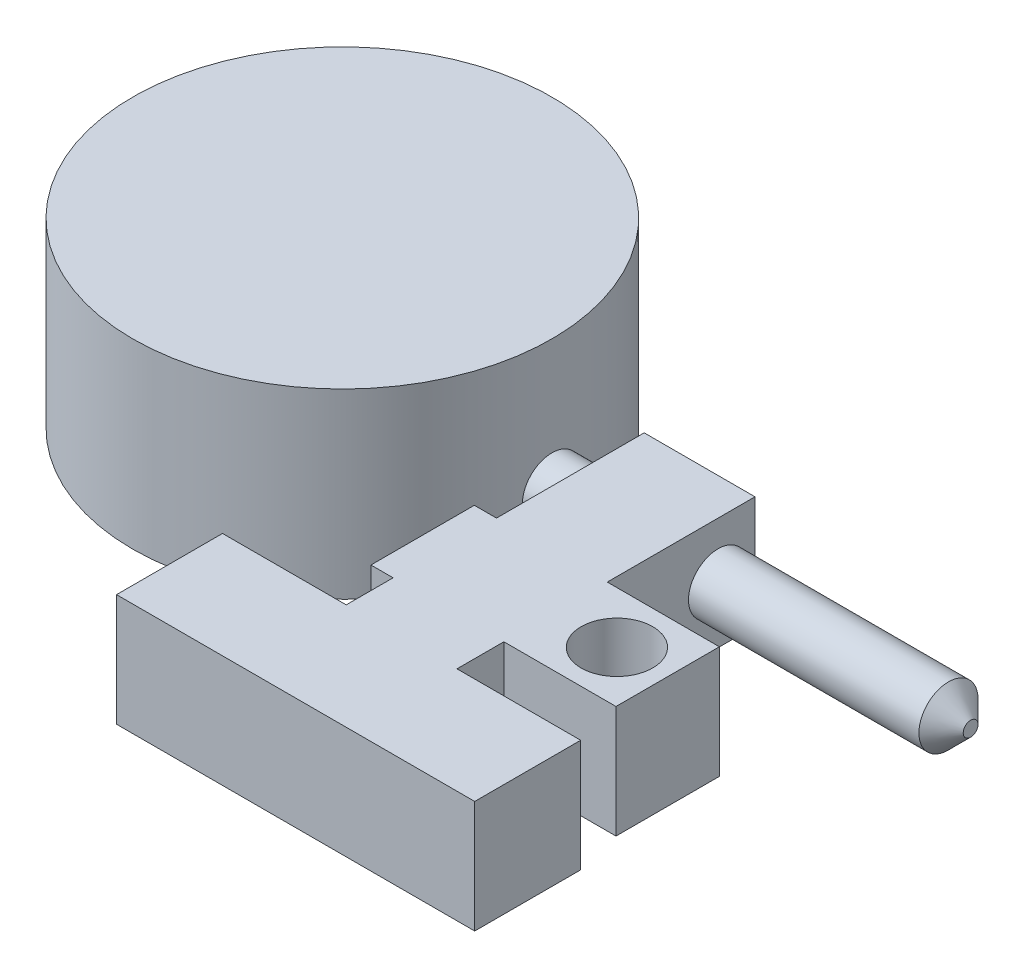
ISO-10303-21;
HEADER;
FILE_DESCRIPTION(('STEP AP214'),'2;1');
FILE_NAME('part.step','',(''),(''),'','','');
FILE_SCHEMA(('AUTOMOTIVE_DESIGN { 1 0 10303 214 1 1 1 1 }'));
ENDSEC;
DATA;
#1=APPLICATION_CONTEXT('core data for automotive mechanical design processes');
#2=APPLICATION_PROTOCOL_DEFINITION('international standard','automotive_design',2000,#1);
#3=PRODUCT_CONTEXT('',#1,'mechanical');
#4=PRODUCT('Part','Part','',(#3));
#5=PRODUCT_RELATED_PRODUCT_CATEGORY('part','',(#4));
#6=PRODUCT_DEFINITION_FORMATION('','',#4);
#7=PRODUCT_DEFINITION_CONTEXT('part definition',#1,'design');
#8=PRODUCT_DEFINITION('design','',#6,#7);
#9=PRODUCT_DEFINITION_SHAPE('','',#8);
#10=(LENGTH_UNIT() NAMED_UNIT(*) SI_UNIT(.MILLI.,.METRE.));
#11=(NAMED_UNIT(*) PLANE_ANGLE_UNIT() SI_UNIT($,.RADIAN.));
#12=(NAMED_UNIT(*) SI_UNIT($,.STERADIAN.) SOLID_ANGLE_UNIT());
#13=UNCERTAINTY_MEASURE_WITH_UNIT(LENGTH_MEASURE(1.E-05),#10,'distance_accuracy_value','');
#14=(GEOMETRIC_REPRESENTATION_CONTEXT(3) GLOBAL_UNCERTAINTY_ASSIGNED_CONTEXT((#13)) GLOBAL_UNIT_ASSIGNED_CONTEXT((#10,
#11,#12)) REPRESENTATION_CONTEXT('',''));
#15=CARTESIAN_POINT('',(0.,0.,0.));
#16=DIRECTION('',(0.,0.,1.));
#17=DIRECTION('',(1.,0.,0.));
#18=AXIS2_PLACEMENT_3D('',#15,#16,#17);
#19=CARTESIAN_POINT('',(85.075,7.3,0.));
#20=DIRECTION('',(-1.,0.,0.));
#21=DIRECTION('',(0.,0.,1.));
#22=AXIS2_PLACEMENT_3D('',#19,#20,#21);
#23=CYLINDRICAL_SURFACE('',#22,4.);
#24=CARTESIAN_POINT('',(82.075,7.3,0.));
#25=DIRECTION('',(1.,0.,0.));
#26=DIRECTION('',(0.,0.,-1.));
#27=AXIS2_PLACEMENT_3D('',#24,#25,#26);
#28=CIRCLE('',#27,4.);
#29=CARTESIAN_POINT('',(82.075,7.3,-4.));
#30=VERTEX_POINT('',#29);
#31=EDGE_CURVE('E272',#30,#30,#28,.F.);
#32=ORIENTED_EDGE('',*,*,#31,.T.);
#33=EDGE_LOOP('',(#32));
#34=FACE_BOUND('',#33,.T.);
#35=CARTESIAN_POINT('',(50.875,7.3,0.));
#36=DIRECTION('',(-1.,0.,0.));
#37=DIRECTION('',(0.,0.,1.));
#38=AXIS2_PLACEMENT_3D('',#35,#36,#37);
#39=CIRCLE('',#38,4.);
#40=CARTESIAN_POINT('',(50.875,7.3,4.));
#41=VERTEX_POINT('',#40);
#42=EDGE_CURVE('E59',#41,#41,#39,.T.);
#43=ORIENTED_EDGE('',*,*,#42,.F.);
#44=EDGE_LOOP('',(#43));
#45=FACE_BOUND('',#44,.T.);
#46=ADVANCED_FACE('F49',(#34,#45),#23,.T.);
#47=CARTESIAN_POINT('',(85.075,7.3,0.));
#48=DIRECTION('',(1.,0.,0.));
#49=DIRECTION('',(0.,0.,-1.));
#50=AXIS2_PLACEMENT_3D('',#47,#48,#49);
#51=PLANE('',#50);
#52=CARTESIAN_POINT('',(85.075,7.3,0.));
#53=DIRECTION('',(1.,0.,0.));
#54=DIRECTION('',(0.,0.,-1.));
#55=AXIS2_PLACEMENT_3D('',#52,#53,#54);
#56=CIRCLE('',#55,1.00000000000003);
#57=CARTESIAN_POINT('',(85.075,7.3,-1.00000000000003));
#58=VERTEX_POINT('',#57);
#59=EDGE_CURVE('E269',#58,#58,#56,.T.);
#60=ORIENTED_EDGE('',*,*,#59,.T.);
#61=EDGE_LOOP('',(#60));
#62=FACE_BOUND('',#61,.T.);
#63=ADVANCED_FACE('F280',(#62),#51,.T.);
#64=CARTESIAN_POINT('',(85.075,7.3,0.));
#65=DIRECTION('',(-1.,0.,0.));
#66=DIRECTION('',(0.,0.,1.));
#67=AXIS2_PLACEMENT_3D('',#64,#65,#66);
#68=CONICAL_SURFACE('',#67,1.00000000000003,0.785398163397447);
#69=ORIENTED_EDGE('',*,*,#31,.F.);
#70=EDGE_LOOP('',(#69));
#71=FACE_BOUND('',#70,.T.);
#72=ORIENTED_EDGE('',*,*,#59,.F.);
#73=EDGE_LOOP('',(#72));
#74=FACE_BOUND('',#73,.T.);
#75=ADVANCED_FACE('F52',(#71,#74),#68,.T.);
#76=CARTESIAN_POINT('',(50.875,14.9,-5.00000000000001));
#77=DIRECTION('',(0.,0.,1.));
#78=DIRECTION('',(1.,0.,0.));
#79=AXIS2_PLACEMENT_3D('',#76,#77,#78);
#80=PLANE('',#79);
#81=DIRECTION('',(-1.,0.,0.));
#82=VECTOR('',#81,1.);
#83=CARTESIAN_POINT('',(50.875,-0.3,-5.00000000000001));
#84=LINE('',#83,#82);
#85=CARTESIAN_POINT('',(50.875,-0.3,-5.00000000000001));
#86=VERTEX_POINT('',#85);
#87=CARTESIAN_POINT('',(35.875,-0.3,-5.00000000000001));
#88=VERTEX_POINT('',#87);
#89=EDGE_CURVE('E196',#86,#88,#84,.T.);
#90=ORIENTED_EDGE('',*,*,#89,.T.);
#91=DIRECTION('',(0.,-1.,0.));
#92=VECTOR('',#91,1.);
#93=CARTESIAN_POINT('',(35.875,14.9,-5.00000000000001));
#94=LINE('',#93,#92);
#95=CARTESIAN_POINT('',(35.875,14.9,-5.00000000000001));
#96=VERTEX_POINT('',#95);
#97=EDGE_CURVE('E264',#96,#88,#94,.T.);
#98=ORIENTED_EDGE('',*,*,#97,.F.);
#99=DIRECTION('',(-1.,0.,0.));
#100=VECTOR('',#99,1.);
#101=CARTESIAN_POINT('',(50.875,14.9,-5.00000000000001));
#102=LINE('',#101,#100);
#103=CARTESIAN_POINT('',(50.875,14.9,-5.00000000000001));
#104=VERTEX_POINT('',#103);
#105=EDGE_CURVE('E227',#104,#96,#102,.T.);
#106=ORIENTED_EDGE('',*,*,#105,.F.);
#107=DIRECTION('',(0.,-1.,0.));
#108=VECTOR('',#107,1.);
#109=CARTESIAN_POINT('',(50.875,14.9,-5.00000000000001));
#110=LINE('',#109,#108);
#111=EDGE_CURVE('E192',#104,#86,#110,.T.);
#112=ORIENTED_EDGE('',*,*,#111,.T.);
#113=EDGE_LOOP('',(#90,#98,#106,#112));
#114=FACE_BOUND('',#113,.T.);
#115=ADVANCED_FACE('F312',(#114),#80,.F.);
#116=CARTESIAN_POINT('',(35.875,14.9,-5.00000000000001));
#117=DIRECTION('',(1.,0.,0.));
#118=DIRECTION('',(0.,0.,-1.));
#119=AXIS2_PLACEMENT_3D('',#116,#117,#118);
#120=PLANE('',#119);
#121=CARTESIAN_POINT('',(35.875,7.3,0.));
#122=DIRECTION('',(1.,0.,0.));
#123=DIRECTION('',(0.,0.,-1.));
#124=AXIS2_PLACEMENT_3D('',#121,#122,#123);
#125=CIRCLE('',#124,4.);
#126=CARTESIAN_POINT('',(35.875,7.3,-4.));
#127=VERTEX_POINT('',#126);
#128=EDGE_CURVE('E12',#127,#127,#125,.T.);
#129=ORIENTED_EDGE('',*,*,#128,.T.);
#130=EDGE_LOOP('',(#129));
#131=FACE_BOUND('',#130,.T.);
#132=DIRECTION('',(0.,0.,1.));
#133=VECTOR('',#132,1.);
#134=CARTESIAN_POINT('',(35.875,-0.3,-5.00000000000001));
#135=LINE('',#134,#133);
#136=CARTESIAN_POINT('',(35.875,-0.3,15.));
#137=VERTEX_POINT('',#136);
#138=EDGE_CURVE('E199',#88,#137,#135,.T.);
#139=ORIENTED_EDGE('',*,*,#138,.T.);
#140=DIRECTION('',(0.,-1.,0.));
#141=VECTOR('',#140,1.);
#142=CARTESIAN_POINT('',(35.875,14.9,15.));
#143=LINE('',#142,#141);
#144=CARTESIAN_POINT('',(35.875,14.9,15.));
#145=VERTEX_POINT('',#144);
#146=EDGE_CURVE('E261',#145,#137,#143,.T.);
#147=ORIENTED_EDGE('',*,*,#146,.F.);
#148=DIRECTION('',(0.,0.,1.));
#149=VECTOR('',#148,1.);
#150=CARTESIAN_POINT('',(35.875,14.9,-5.00000000000001));
#151=LINE('',#150,#149);
#152=EDGE_CURVE('E135',#96,#145,#151,.T.);
#153=ORIENTED_EDGE('',*,*,#152,.F.);
#154=ORIENTED_EDGE('',*,*,#97,.T.);
#155=EDGE_LOOP('',(#139,#147,#153,#154));
#156=FACE_BOUND('',#155,.T.);
#157=ADVANCED_FACE('F309',(#131,#156),#120,.F.);
#158=CARTESIAN_POINT('',(35.875,14.9,15.));
#159=DIRECTION('',(0.,0.,1.));
#160=DIRECTION('',(1.,0.,0.));
#161=AXIS2_PLACEMENT_3D('',#158,#159,#160);
#162=PLANE('',#161);
#163=DIRECTION('',(-1.,0.,0.));
#164=VECTOR('',#163,1.);
#165=CARTESIAN_POINT('',(35.875,-0.3,15.));
#166=LINE('',#165,#164);
#167=CARTESIAN_POINT('',(32.875,-0.3,15.));
#168=VERTEX_POINT('',#167);
#169=EDGE_CURVE('E202',#137,#168,#166,.T.);
#170=ORIENTED_EDGE('',*,*,#169,.T.);
#171=DIRECTION('',(0.,-1.,0.));
#172=VECTOR('',#171,1.);
#173=CARTESIAN_POINT('',(32.875,14.9,15.));
#174=LINE('',#173,#172);
#175=CARTESIAN_POINT('',(32.875,14.9,15.));
#176=VERTEX_POINT('',#175);
#177=EDGE_CURVE('E258',#176,#168,#174,.T.);
#178=ORIENTED_EDGE('',*,*,#177,.F.);
#179=DIRECTION('',(-1.,0.,0.));
#180=VECTOR('',#179,1.);
#181=CARTESIAN_POINT('',(35.875,14.9,15.));
#182=LINE('',#181,#180);
#183=EDGE_CURVE('E321',#145,#176,#182,.T.);
#184=ORIENTED_EDGE('',*,*,#183,.F.);
#185=ORIENTED_EDGE('',*,*,#146,.T.);
#186=EDGE_LOOP('',(#170,#178,#184,#185));
#187=FACE_BOUND('',#186,.T.);
#188=ADVANCED_FACE('F311',(#187),#162,.F.);
#189=CARTESIAN_POINT('',(32.875,14.9,15.));
#190=DIRECTION('',(1.,0.,0.));
#191=DIRECTION('',(0.,0.,-1.));
#192=AXIS2_PLACEMENT_3D('',#189,#190,#191);
#193=PLANE('',#192);
#194=DIRECTION('',(0.,0.,1.));
#195=VECTOR('',#194,1.);
#196=CARTESIAN_POINT('',(32.875,-0.3,15.));
#197=LINE('',#196,#195);
#198=CARTESIAN_POINT('',(32.875,-0.3,29.));
#199=VERTEX_POINT('',#198);
#200=EDGE_CURVE('E204',#168,#199,#197,.T.);
#201=ORIENTED_EDGE('',*,*,#200,.T.);
#202=DIRECTION('',(0.,-1.,0.));
#203=VECTOR('',#202,1.);
#204=CARTESIAN_POINT('',(32.875,14.9,29.));
#205=LINE('',#204,#203);
#206=CARTESIAN_POINT('',(32.875,14.9,29.));
#207=VERTEX_POINT('',#206);
#208=EDGE_CURVE('E255',#207,#199,#205,.T.);
#209=ORIENTED_EDGE('',*,*,#208,.F.);
#210=DIRECTION('',(0.,0.,1.));
#211=VECTOR('',#210,1.);
#212=CARTESIAN_POINT('',(32.875,14.9,15.));
#213=LINE('',#212,#211);
#214=EDGE_CURVE('E336',#176,#207,#213,.T.);
#215=ORIENTED_EDGE('',*,*,#214,.F.);
#216=ORIENTED_EDGE('',*,*,#177,.T.);
#217=EDGE_LOOP('',(#201,#209,#215,#216));
#218=FACE_BOUND('',#217,.T.);
#219=ADVANCED_FACE('F327',(#218),#193,.F.);
#220=CARTESIAN_POINT('',(32.875,14.9,29.));
#221=DIRECTION('',(0.,0.,-1.));
#222=DIRECTION('',(-1.,0.,0.));
#223=AXIS2_PLACEMENT_3D('',#220,#221,#222);
#224=PLANE('',#223);
#225=DIRECTION('',(1.,0.,0.));
#226=VECTOR('',#225,1.);
#227=CARTESIAN_POINT('',(32.875,-0.3,29.));
#228=LINE('',#227,#226);
#229=CARTESIAN_POINT('',(35.875,-0.3,29.));
#230=VERTEX_POINT('',#229);
#231=EDGE_CURVE('E206',#199,#230,#228,.T.);
#232=ORIENTED_EDGE('',*,*,#231,.T.);
#233=DIRECTION('',(0.,-1.,0.));
#234=VECTOR('',#233,1.);
#235=CARTESIAN_POINT('',(35.875,14.9,29.));
#236=LINE('',#235,#234);
#237=CARTESIAN_POINT('',(35.875,14.9,29.));
#238=VERTEX_POINT('',#237);
#239=EDGE_CURVE('E252',#238,#230,#236,.T.);
#240=ORIENTED_EDGE('',*,*,#239,.F.);
#241=DIRECTION('',(1.,0.,0.));
#242=VECTOR('',#241,1.);
#243=CARTESIAN_POINT('',(32.875,14.9,29.));
#244=LINE('',#243,#242);
#245=EDGE_CURVE('E333',#207,#238,#244,.T.);
#246=ORIENTED_EDGE('',*,*,#245,.F.);
#247=ORIENTED_EDGE('',*,*,#208,.T.);
#248=EDGE_LOOP('',(#232,#240,#246,#247));
#249=FACE_BOUND('',#248,.T.);
#250=ADVANCED_FACE('F331',(#249),#224,.F.);
#251=CARTESIAN_POINT('',(35.875,14.9,29.));
#252=DIRECTION('',(1.,0.,0.));
#253=DIRECTION('',(0.,0.,-1.));
#254=AXIS2_PLACEMENT_3D('',#251,#252,#253);
#255=PLANE('',#254);
#256=DIRECTION('',(0.,0.,1.));
#257=VECTOR('',#256,1.);
#258=CARTESIAN_POINT('',(35.875,-0.3,29.));
#259=LINE('',#258,#257);
#260=CARTESIAN_POINT('',(35.875,-0.3,35.35));
#261=VERTEX_POINT('',#260);
#262=EDGE_CURVE('E208',#230,#261,#259,.T.);
#263=ORIENTED_EDGE('',*,*,#262,.T.);
#264=DIRECTION('',(0.,-1.,0.));
#265=VECTOR('',#264,1.);
#266=CARTESIAN_POINT('',(35.875,14.9,35.35));
#267=LINE('',#266,#265);
#268=CARTESIAN_POINT('',(35.875,14.9,35.35));
#269=VERTEX_POINT('',#268);
#270=EDGE_CURVE('E249',#269,#261,#267,.T.);
#271=ORIENTED_EDGE('',*,*,#270,.F.);
#272=DIRECTION('',(0.,0.,1.));
#273=VECTOR('',#272,1.);
#274=CARTESIAN_POINT('',(35.875,14.9,29.));
#275=LINE('',#274,#273);
#276=EDGE_CURVE('E335',#238,#269,#275,.T.);
#277=ORIENTED_EDGE('',*,*,#276,.F.);
#278=ORIENTED_EDGE('',*,*,#239,.T.);
#279=EDGE_LOOP('',(#263,#271,#277,#278));
#280=FACE_BOUND('',#279,.T.);
#281=ADVANCED_FACE('F399',(#280),#255,.F.);
#282=CARTESIAN_POINT('',(35.875,14.9,35.35));
#283=DIRECTION('',(0.,0.,1.));
#284=DIRECTION('',(1.,0.,0.));
#285=AXIS2_PLACEMENT_3D('',#282,#283,#284);
#286=PLANE('',#285);
#287=DIRECTION('',(-1.,0.,0.));
#288=VECTOR('',#287,1.);
#289=CARTESIAN_POINT('',(35.875,-0.3,35.35));
#290=LINE('',#289,#288);
#291=CARTESIAN_POINT('',(19.125,-0.3,35.35));
#292=VERTEX_POINT('',#291);
#293=EDGE_CURVE('E210',#261,#292,#290,.T.);
#294=ORIENTED_EDGE('',*,*,#293,.T.);
#295=DIRECTION('',(0.,-1.,0.));
#296=VECTOR('',#295,1.);
#297=CARTESIAN_POINT('',(19.125,14.9,35.35));
#298=LINE('',#297,#296);
#299=CARTESIAN_POINT('',(19.125,14.9,35.35));
#300=VERTEX_POINT('',#299);
#301=EDGE_CURVE('E246',#300,#292,#298,.T.);
#302=ORIENTED_EDGE('',*,*,#301,.F.);
#303=DIRECTION('',(-1.,0.,0.));
#304=VECTOR('',#303,1.);
#305=CARTESIAN_POINT('',(35.875,14.9,35.35));
#306=LINE('',#305,#304);
#307=EDGE_CURVE('E338',#269,#300,#306,.T.);
#308=ORIENTED_EDGE('',*,*,#307,.F.);
#309=ORIENTED_EDGE('',*,*,#270,.T.);
#310=EDGE_LOOP('',(#294,#302,#308,#309));
#311=FACE_BOUND('',#310,.T.);
#312=ADVANCED_FACE('F395',(#311),#286,.F.);
#313=CARTESIAN_POINT('',(19.125,14.9,35.35));
#314=DIRECTION('',(1.,0.,0.));
#315=DIRECTION('',(0.,0.,-1.));
#316=AXIS2_PLACEMENT_3D('',#313,#314,#315);
#317=PLANE('',#316);
#318=DIRECTION('',(0.,0.,1.));
#319=VECTOR('',#318,1.);
#320=CARTESIAN_POINT('',(19.125,-0.3,35.35));
#321=LINE('',#320,#319);
#322=CARTESIAN_POINT('',(19.125,-0.3,49.7));
#323=VERTEX_POINT('',#322);
#324=EDGE_CURVE('E212',#292,#323,#321,.T.);
#325=ORIENTED_EDGE('',*,*,#324,.T.);
#326=DIRECTION('',(0.,-1.,0.));
#327=VECTOR('',#326,1.);
#328=CARTESIAN_POINT('',(19.125,14.9,49.7));
#329=LINE('',#328,#327);
#330=CARTESIAN_POINT('',(19.125,14.9,49.7));
#331=VERTEX_POINT('',#330);
#332=EDGE_CURVE('E243',#331,#323,#329,.T.);
#333=ORIENTED_EDGE('',*,*,#332,.F.);
#334=DIRECTION('',(0.,0.,1.));
#335=VECTOR('',#334,1.);
#336=CARTESIAN_POINT('',(19.125,14.9,35.35));
#337=LINE('',#336,#335);
#338=EDGE_CURVE('E344',#300,#331,#337,.T.);
#339=ORIENTED_EDGE('',*,*,#338,.F.);
#340=ORIENTED_EDGE('',*,*,#301,.T.);
#341=EDGE_LOOP('',(#325,#333,#339,#340));
#342=FACE_BOUND('',#341,.T.);
#343=ADVANCED_FACE('F391',(#342),#317,.F.);
#344=CARTESIAN_POINT('',(19.125,14.9,49.7));
#345=DIRECTION('',(0.,0.,-1.));
#346=DIRECTION('',(-1.,0.,0.));
#347=AXIS2_PLACEMENT_3D('',#344,#345,#346);
#348=PLANE('',#347);
#349=DIRECTION('',(1.,0.,0.));
#350=VECTOR('',#349,1.);
#351=CARTESIAN_POINT('',(19.125,-0.3,49.7));
#352=LINE('',#351,#350);
#353=CARTESIAN_POINT('',(67.625,-0.3,49.7));
#354=VERTEX_POINT('',#353);
#355=EDGE_CURVE('E214',#323,#354,#352,.T.);
#356=ORIENTED_EDGE('',*,*,#355,.T.);
#357=DIRECTION('',(0.,-1.,0.));
#358=VECTOR('',#357,1.);
#359=CARTESIAN_POINT('',(67.625,14.9,49.7));
#360=LINE('',#359,#358);
#361=CARTESIAN_POINT('',(67.625,14.9,49.7));
#362=VERTEX_POINT('',#361);
#363=EDGE_CURVE('E240',#362,#354,#360,.T.);
#364=ORIENTED_EDGE('',*,*,#363,.F.);
#365=DIRECTION('',(1.,0.,0.));
#366=VECTOR('',#365,1.);
#367=CARTESIAN_POINT('',(19.125,14.9,49.7));
#368=LINE('',#367,#366);
#369=EDGE_CURVE('E346',#331,#362,#368,.T.);
#370=ORIENTED_EDGE('',*,*,#369,.F.);
#371=ORIENTED_EDGE('',*,*,#332,.T.);
#372=EDGE_LOOP('',(#356,#364,#370,#371));
#373=FACE_BOUND('',#372,.T.);
#374=ADVANCED_FACE('F387',(#373),#348,.F.);
#375=CARTESIAN_POINT('',(67.625,14.9,49.7));
#376=DIRECTION('',(-1.,0.,0.));
#377=DIRECTION('',(0.,0.,1.));
#378=AXIS2_PLACEMENT_3D('',#375,#376,#377);
#379=PLANE('',#378);
#380=DIRECTION('',(0.,0.,-1.));
#381=VECTOR('',#380,1.);
#382=CARTESIAN_POINT('',(67.625,-0.3,49.7));
#383=LINE('',#382,#381);
#384=CARTESIAN_POINT('',(67.625,-0.3,35.35));
#385=VERTEX_POINT('',#384);
#386=EDGE_CURVE('E216',#354,#385,#383,.T.);
#387=ORIENTED_EDGE('',*,*,#386,.T.);
#388=DIRECTION('',(0.,-1.,0.));
#389=VECTOR('',#388,1.);
#390=CARTESIAN_POINT('',(67.625,14.9,35.35));
#391=LINE('',#390,#389);
#392=CARTESIAN_POINT('',(67.625,14.9,35.35));
#393=VERTEX_POINT('',#392);
#394=EDGE_CURVE('E237',#393,#385,#391,.T.);
#395=ORIENTED_EDGE('',*,*,#394,.F.);
#396=DIRECTION('',(0.,0.,-1.));
#397=VECTOR('',#396,1.);
#398=CARTESIAN_POINT('',(67.625,14.9,49.7));
#399=LINE('',#398,#397);
#400=EDGE_CURVE('E348',#362,#393,#399,.T.);
#401=ORIENTED_EDGE('',*,*,#400,.F.);
#402=ORIENTED_EDGE('',*,*,#363,.T.);
#403=EDGE_LOOP('',(#387,#395,#401,#402));
#404=FACE_BOUND('',#403,.T.);
#405=ADVANCED_FACE('F383',(#404),#379,.F.);
#406=CARTESIAN_POINT('',(67.625,14.9,35.35));
#407=DIRECTION('',(0.,0.,1.));
#408=DIRECTION('',(1.,0.,0.));
#409=AXIS2_PLACEMENT_3D('',#406,#407,#408);
#410=PLANE('',#409);
#411=DIRECTION('',(-1.,0.,0.));
#412=VECTOR('',#411,1.);
#413=CARTESIAN_POINT('',(67.625,-0.3,35.35));
#414=LINE('',#413,#412);
#415=CARTESIAN_POINT('',(50.875,-0.3,35.35));
#416=VERTEX_POINT('',#415);
#417=EDGE_CURVE('E218',#385,#416,#414,.T.);
#418=ORIENTED_EDGE('',*,*,#417,.T.);
#419=DIRECTION('',(0.,-1.,0.));
#420=VECTOR('',#419,1.);
#421=CARTESIAN_POINT('',(50.875,14.9,35.35));
#422=LINE('',#421,#420);
#423=CARTESIAN_POINT('',(50.875,14.9,35.35));
#424=VERTEX_POINT('',#423);
#425=EDGE_CURVE('E234',#424,#416,#422,.T.);
#426=ORIENTED_EDGE('',*,*,#425,.F.);
#427=DIRECTION('',(-1.,0.,0.));
#428=VECTOR('',#427,1.);
#429=CARTESIAN_POINT('',(67.625,14.9,35.35));
#430=LINE('',#429,#428);
#431=EDGE_CURVE('E350',#393,#424,#430,.T.);
#432=ORIENTED_EDGE('',*,*,#431,.F.);
#433=ORIENTED_EDGE('',*,*,#394,.T.);
#434=EDGE_LOOP('',(#418,#426,#432,#433));
#435=FACE_BOUND('',#434,.T.);
#436=ADVANCED_FACE('F380',(#435),#410,.F.);
#437=CARTESIAN_POINT('',(50.875,14.9,35.35));
#438=DIRECTION('',(-1.,0.,0.));
#439=DIRECTION('',(0.,0.,1.));
#440=AXIS2_PLACEMENT_3D('',#437,#438,#439);
#441=PLANE('',#440);
#442=DIRECTION('',(0.,0.,-1.));
#443=VECTOR('',#442,1.);
#444=CARTESIAN_POINT('',(50.875,-0.3,35.35));
#445=LINE('',#444,#443);
#446=CARTESIAN_POINT('',(50.875,-0.3,29.));
#447=VERTEX_POINT('',#446);
#448=EDGE_CURVE('E220',#416,#447,#445,.T.);
#449=ORIENTED_EDGE('',*,*,#448,.T.);
#450=DIRECTION('',(0.,-1.,0.));
#451=VECTOR('',#450,1.);
#452=CARTESIAN_POINT('',(50.875,14.9,29.));
#453=LINE('',#452,#451);
#454=CARTESIAN_POINT('',(50.875,14.9,29.));
#455=VERTEX_POINT('',#454);
#456=EDGE_CURVE('E231',#455,#447,#453,.T.);
#457=ORIENTED_EDGE('',*,*,#456,.F.);
#458=DIRECTION('',(0.,0.,-1.));
#459=VECTOR('',#458,1.);
#460=CARTESIAN_POINT('',(50.875,14.9,35.35));
#461=LINE('',#460,#459);
#462=EDGE_CURVE('E352',#424,#455,#461,.T.);
#463=ORIENTED_EDGE('',*,*,#462,.F.);
#464=ORIENTED_EDGE('',*,*,#425,.T.);
#465=EDGE_LOOP('',(#449,#457,#463,#464));
#466=FACE_BOUND('',#465,.T.);
#467=ADVANCED_FACE('F358',(#466),#441,.F.);
#468=CARTESIAN_POINT('',(50.875,14.9,29.));
#469=DIRECTION('',(0.,0.,-1.));
#470=DIRECTION('',(-1.,0.,0.));
#471=AXIS2_PLACEMENT_3D('',#468,#469,#470);
#472=PLANE('',#471);
#473=DIRECTION('',(1.,0.,0.));
#474=VECTOR('',#473,1.);
#475=CARTESIAN_POINT('',(50.875,-0.3,29.));
#476=LINE('',#475,#474);
#477=CARTESIAN_POINT('',(66.055,-0.3,29.));
#478=VERTEX_POINT('',#477);
#479=EDGE_CURVE('E222',#447,#478,#476,.T.);
#480=ORIENTED_EDGE('',*,*,#479,.T.);
#481=DIRECTION('',(0.,-1.,0.));
#482=VECTOR('',#481,1.);
#483=CARTESIAN_POINT('',(66.055,14.9,29.));
#484=LINE('',#483,#482);
#485=CARTESIAN_POINT('',(66.055,14.9,29.));
#486=VERTEX_POINT('',#485);
#487=EDGE_CURVE('E187',#486,#478,#484,.T.);
#488=ORIENTED_EDGE('',*,*,#487,.F.);
#489=DIRECTION('',(1.,0.,0.));
#490=VECTOR('',#489,1.);
#491=CARTESIAN_POINT('',(50.875,14.9,29.));
#492=LINE('',#491,#490);
#493=EDGE_CURVE('E178',#455,#486,#492,.T.);
#494=ORIENTED_EDGE('',*,*,#493,.F.);
#495=ORIENTED_EDGE('',*,*,#456,.T.);
#496=EDGE_LOOP('',(#480,#488,#494,#495));
#497=FACE_BOUND('',#496,.T.);
#498=ADVANCED_FACE('F362',(#497),#472,.F.);
#499=CARTESIAN_POINT('',(66.055,14.9,29.));
#500=DIRECTION('',(-1.,0.,0.));
#501=DIRECTION('',(0.,0.,1.));
#502=AXIS2_PLACEMENT_3D('',#499,#500,#501);
#503=PLANE('',#502);
#504=DIRECTION('',(0.,0.,-1.));
#505=VECTOR('',#504,1.);
#506=CARTESIAN_POINT('',(66.055,-0.3,29.));
#507=LINE('',#506,#505);
#508=CARTESIAN_POINT('',(66.055,-0.3,15.));
#509=VERTEX_POINT('',#508);
#510=EDGE_CURVE('E186',#478,#509,#507,.T.);
#511=ORIENTED_EDGE('',*,*,#510,.T.);
#512=DIRECTION('',(0.,-1.,0.));
#513=VECTOR('',#512,1.);
#514=CARTESIAN_POINT('',(66.055,14.9,15.));
#515=LINE('',#514,#513);
#516=CARTESIAN_POINT('',(66.055,14.9,15.));
#517=VERTEX_POINT('',#516);
#518=EDGE_CURVE('E183',#517,#509,#515,.T.);
#519=ORIENTED_EDGE('',*,*,#518,.F.);
#520=DIRECTION('',(0.,0.,-1.));
#521=VECTOR('',#520,1.);
#522=CARTESIAN_POINT('',(66.055,14.9,29.));
#523=LINE('',#522,#521);
#524=EDGE_CURVE('E172',#486,#517,#523,.T.);
#525=ORIENTED_EDGE('',*,*,#524,.F.);
#526=ORIENTED_EDGE('',*,*,#487,.T.);
#527=EDGE_LOOP('',(#511,#519,#525,#526));
#528=FACE_BOUND('',#527,.T.);
#529=ADVANCED_FACE('F184',(#528),#503,.F.);
#530=CARTESIAN_POINT('',(66.055,14.9,15.));
#531=DIRECTION('',(0.,0.,1.));
#532=DIRECTION('',(1.,0.,0.));
#533=AXIS2_PLACEMENT_3D('',#530,#531,#532);
#534=PLANE('',#533);
#535=DIRECTION('',(-1.,0.,0.));
#536=VECTOR('',#535,1.);
#537=CARTESIAN_POINT('',(66.055,-0.3,15.));
#538=LINE('',#537,#536);
#539=CARTESIAN_POINT('',(50.875,-0.3,15.));
#540=VERTEX_POINT('',#539);
#541=EDGE_CURVE('E120',#509,#540,#538,.T.);
#542=ORIENTED_EDGE('',*,*,#541,.T.);
#543=DIRECTION('',(0.,-1.,0.));
#544=VECTOR('',#543,1.);
#545=CARTESIAN_POINT('',(50.875,14.9,15.));
#546=LINE('',#545,#544);
#547=CARTESIAN_POINT('',(50.875,14.9,15.));
#548=VERTEX_POINT('',#547);
#549=EDGE_CURVE('E188',#548,#540,#546,.T.);
#550=ORIENTED_EDGE('',*,*,#549,.F.);
#551=DIRECTION('',(-1.,0.,0.));
#552=VECTOR('',#551,1.);
#553=CARTESIAN_POINT('',(66.055,14.9,15.));
#554=LINE('',#553,#552);
#555=EDGE_CURVE('E176',#517,#548,#554,.T.);
#556=ORIENTED_EDGE('',*,*,#555,.F.);
#557=ORIENTED_EDGE('',*,*,#518,.T.);
#558=EDGE_LOOP('',(#542,#550,#556,#557));
#559=FACE_BOUND('',#558,.T.);
#560=ADVANCED_FACE('F190',(#559),#534,.F.);
#561=CARTESIAN_POINT('',(50.875,14.9,15.));
#562=DIRECTION('',(-1.,0.,0.));
#563=DIRECTION('',(0.,0.,1.));
#564=AXIS2_PLACEMENT_3D('',#561,#562,#563);
#565=PLANE('',#564);
#566=ORIENTED_EDGE('',*,*,#42,.T.);
#567=EDGE_LOOP('',(#566));
#568=FACE_BOUND('',#567,.T.);
#569=DIRECTION('',(0.,0.,-1.));
#570=VECTOR('',#569,1.);
#571=CARTESIAN_POINT('',(50.875,-0.3,15.));
#572=LINE('',#571,#570);
#573=EDGE_CURVE('E126',#540,#86,#572,.T.);
#574=ORIENTED_EDGE('',*,*,#573,.T.);
#575=ORIENTED_EDGE('',*,*,#111,.F.);
#576=DIRECTION('',(0.,0.,-1.));
#577=VECTOR('',#576,1.);
#578=CARTESIAN_POINT('',(50.875,14.9,15.));
#579=LINE('',#578,#577);
#580=EDGE_CURVE('E67',#548,#104,#579,.T.);
#581=ORIENTED_EDGE('',*,*,#580,.F.);
#582=ORIENTED_EDGE('',*,*,#549,.T.);
#583=EDGE_LOOP('',(#574,#575,#581,#582));
#584=FACE_BOUND('',#583,.T.);
#585=ADVANCED_FACE('F277',(#568,#584),#565,.F.);
#586=CARTESIAN_POINT('',(0.,14.9,0.));
#587=DIRECTION('',(0.,1.,0.));
#588=DIRECTION('',(0.,0.,1.));
#589=AXIS2_PLACEMENT_3D('',#586,#587,#588);
#590=PLANE('',#589);
#591=CARTESIAN_POINT('',(59.18,14.9,22.));
#592=DIRECTION('',(0.,1.,0.));
#593=DIRECTION('',(0.,0.,1.));
#594=AXIS2_PLACEMENT_3D('',#591,#592,#593);
#595=CIRCLE('',#594,4.85);
#596=CARTESIAN_POINT('',(59.18,14.9,26.85));
#597=VERTEX_POINT('',#596);
#598=EDGE_CURVE('E543',#597,#597,#595,.T.);
#599=ORIENTED_EDGE('',*,*,#598,.F.);
#600=EDGE_LOOP('',(#599));
#601=FACE_BOUND('',#600,.T.);
#602=ORIENTED_EDGE('',*,*,#105,.T.);
#603=ORIENTED_EDGE('',*,*,#152,.T.);
#604=ORIENTED_EDGE('',*,*,#183,.T.);
#605=ORIENTED_EDGE('',*,*,#214,.T.);
#606=ORIENTED_EDGE('',*,*,#245,.T.);
#607=ORIENTED_EDGE('',*,*,#276,.T.);
#608=ORIENTED_EDGE('',*,*,#307,.T.);
#609=ORIENTED_EDGE('',*,*,#338,.T.);
#610=ORIENTED_EDGE('',*,*,#369,.T.);
#611=ORIENTED_EDGE('',*,*,#400,.T.);
#612=ORIENTED_EDGE('',*,*,#431,.T.);
#613=ORIENTED_EDGE('',*,*,#462,.T.);
#614=ORIENTED_EDGE('',*,*,#493,.T.);
#615=ORIENTED_EDGE('',*,*,#524,.T.);
#616=ORIENTED_EDGE('',*,*,#555,.T.);
#617=ORIENTED_EDGE('',*,*,#580,.T.);
#618=EDGE_LOOP('',(#602,#603,#604,#605,#606,#607,#608,#609,#610,#611,#612,#613,#614,#615,#616,#617));
#619=FACE_BOUND('',#618,.T.);
#620=ADVANCED_FACE('F174',(#601,#619),#590,.T.);
#621=CARTESIAN_POINT('',(0.,-0.3,0.));
#622=DIRECTION('',(0.,1.,0.));
#623=DIRECTION('',(0.,0.,1.));
#624=AXIS2_PLACEMENT_3D('',#621,#622,#623);
#625=PLANE('',#624);
#626=CARTESIAN_POINT('',(59.18,-0.3,22.));
#627=DIRECTION('',(0.,1.,0.));
#628=DIRECTION('',(0.,0.,1.));
#629=AXIS2_PLACEMENT_3D('',#626,#627,#628);
#630=CIRCLE('',#629,4.85);
#631=CARTESIAN_POINT('',(59.18,-0.3,26.85));
#632=VERTEX_POINT('',#631);
#633=EDGE_CURVE('E200',#632,#632,#630,.F.);
#634=ORIENTED_EDGE('',*,*,#633,.F.);
#635=EDGE_LOOP('',(#634));
#636=FACE_BOUND('',#635,.T.);
#637=ORIENTED_EDGE('',*,*,#89,.F.);
#638=ORIENTED_EDGE('',*,*,#573,.F.);
#639=ORIENTED_EDGE('',*,*,#541,.F.);
#640=ORIENTED_EDGE('',*,*,#510,.F.);
#641=ORIENTED_EDGE('',*,*,#479,.F.);
#642=ORIENTED_EDGE('',*,*,#448,.F.);
#643=ORIENTED_EDGE('',*,*,#417,.F.);
#644=ORIENTED_EDGE('',*,*,#386,.F.);
#645=ORIENTED_EDGE('',*,*,#355,.F.);
#646=ORIENTED_EDGE('',*,*,#324,.F.);
#647=ORIENTED_EDGE('',*,*,#293,.F.);
#648=ORIENTED_EDGE('',*,*,#262,.F.);
#649=ORIENTED_EDGE('',*,*,#231,.F.);
#650=ORIENTED_EDGE('',*,*,#200,.F.);
#651=ORIENTED_EDGE('',*,*,#169,.F.);
#652=ORIENTED_EDGE('',*,*,#138,.F.);
#653=EDGE_LOOP('',(#637,#638,#639,#640,#641,#642,#643,#644,#645,#646,#647,#648,#649,#650,#651,#652));
#654=FACE_BOUND('',#653,.T.);
#655=ADVANCED_FACE('F303',(#636,#654),#625,.F.);
#656=CARTESIAN_POINT('',(28.375,7.3,0.));
#657=DIRECTION('',(1.,0.,0.));
#658=DIRECTION('',(0.,0.,-1.));
#659=AXIS2_PLACEMENT_3D('',#656,#657,#658);
#660=PLANE('',#659);
#661=CARTESIAN_POINT('',(28.375,7.3,0.));
#662=DIRECTION('',(1.,0.,0.));
#663=DIRECTION('',(0.,0.,-1.));
#664=AXIS2_PLACEMENT_3D('',#661,#662,#663);
#665=CIRCLE('',#664,4.);
#666=CARTESIAN_POINT('',(28.375,7.3,-4.));
#667=VERTEX_POINT('',#666);
#668=EDGE_CURVE('E266',#667,#667,#665,.T.);
#669=ORIENTED_EDGE('',*,*,#668,.F.);
#670=EDGE_LOOP('',(#669));
#671=FACE_BOUND('',#670,.T.);
#672=ADVANCED_FACE('F293',(#671),#660,.F.);
#673=ORIENTED_EDGE('',*,*,#668,.T.);
#674=EDGE_LOOP('',(#673));
#675=FACE_BOUND('',#674,.T.);
#676=ORIENTED_EDGE('',*,*,#128,.F.);
#677=EDGE_LOOP('',(#676));
#678=FACE_BOUND('',#677,.T.);
#679=ADVANCED_FACE('F282',(#675,#678),#23,.T.);
#680=CARTESIAN_POINT('',(59.18,-0.300999999999999,22.));
#681=DIRECTION('',(0.,1.,0.));
#682=DIRECTION('',(0.,0.,1.));
#683=AXIS2_PLACEMENT_3D('',#680,#681,#682);
#684=CYLINDRICAL_SURFACE('',#683,4.85);
#685=ORIENTED_EDGE('',*,*,#598,.T.);
#686=EDGE_LOOP('',(#685));
#687=FACE_BOUND('',#686,.T.);
#688=ORIENTED_EDGE('',*,*,#633,.T.);
#689=EDGE_LOOP('',(#688));
#690=FACE_BOUND('',#689,.T.);
#691=ADVANCED_FACE('F292',(#687,#690),#684,.F.);
#692=CLOSED_SHELL('',(#46,#63,#75,#115,#157,#188,#219,#250,#281,#312,#343,#374,#405,#436,#467,
#498,#529,#560,#585,#620,#655,#672,#679,#691));
#693=MANIFOLD_SOLID_BREP('B2',#692);
#694=CARTESIAN_POINT('',(0.,24.66,0.));
#695=DIRECTION('',(0.,-1.,0.));
#696=DIRECTION('',(0.,0.,-1.));
#697=AXIS2_PLACEMENT_3D('',#694,#695,#696);
#698=CYLINDRICAL_SURFACE('',#697,28.375);
#699=CARTESIAN_POINT('',(0.,24.66,0.));
#700=DIRECTION('',(0.,1.,0.));
#701=DIRECTION('',(0.,0.,1.));
#702=AXIS2_PLACEMENT_3D('',#699,#700,#701);
#703=CIRCLE('',#702,28.375);
#704=CARTESIAN_POINT('',(0.,24.66,28.375));
#705=VERTEX_POINT('',#704);
#706=EDGE_CURVE('E48',#705,#705,#703,.T.);
#707=ORIENTED_EDGE('',*,*,#706,.F.);
#708=EDGE_LOOP('',(#707));
#709=FACE_BOUND('',#708,.T.);
#710=CARTESIAN_POINT('',(0.,0.,0.));
#711=DIRECTION('',(0.,1.,0.));
#712=DIRECTION('',(0.,0.,1.));
#713=AXIS2_PLACEMENT_3D('',#710,#711,#712);
#714=CIRCLE('',#713,28.375);
#715=CARTESIAN_POINT('',(0.,0.,28.375));
#716=VERTEX_POINT('',#715);
#717=EDGE_CURVE('E585',#716,#716,#714,.T.);
#718=ORIENTED_EDGE('',*,*,#717,.T.);
#719=EDGE_LOOP('',(#718));
#720=FACE_BOUND('',#719,.T.);
#721=ADVANCED_FACE('F582',(#709,#720),#698,.T.);
#722=CARTESIAN_POINT('',(0.,24.66,0.));
#723=DIRECTION('',(0.,1.,0.));
#724=DIRECTION('',(0.,0.,1.));
#725=AXIS2_PLACEMENT_3D('',#722,#723,#724);
#726=PLANE('',#725);
#727=ORIENTED_EDGE('',*,*,#706,.T.);
#728=EDGE_LOOP('',(#727));
#729=FACE_BOUND('',#728,.T.);
#730=ADVANCED_FACE('F597',(#729),#726,.T.);
#731=CARTESIAN_POINT('',(0.,0.,0.));
#732=DIRECTION('',(0.,1.,0.));
#733=DIRECTION('',(0.,0.,1.));
#734=AXIS2_PLACEMENT_3D('',#731,#732,#733);
#735=PLANE('',#734);
#736=ORIENTED_EDGE('',*,*,#717,.F.);
#737=EDGE_LOOP('',(#736));
#738=FACE_BOUND('',#737,.T.);
#739=ADVANCED_FACE('F595',(#738),#735,.F.);
#740=CLOSED_SHELL('',(#721,#730,#739));
#741=MANIFOLD_SOLID_BREP('B6',#740);
#742=ADVANCED_BREP_SHAPE_REPRESENTATION('',(#18,#693,#741),#14);
#743=SHAPE_DEFINITION_REPRESENTATION(#9,#742);
ENDSEC;
END-ISO-10303-21;
